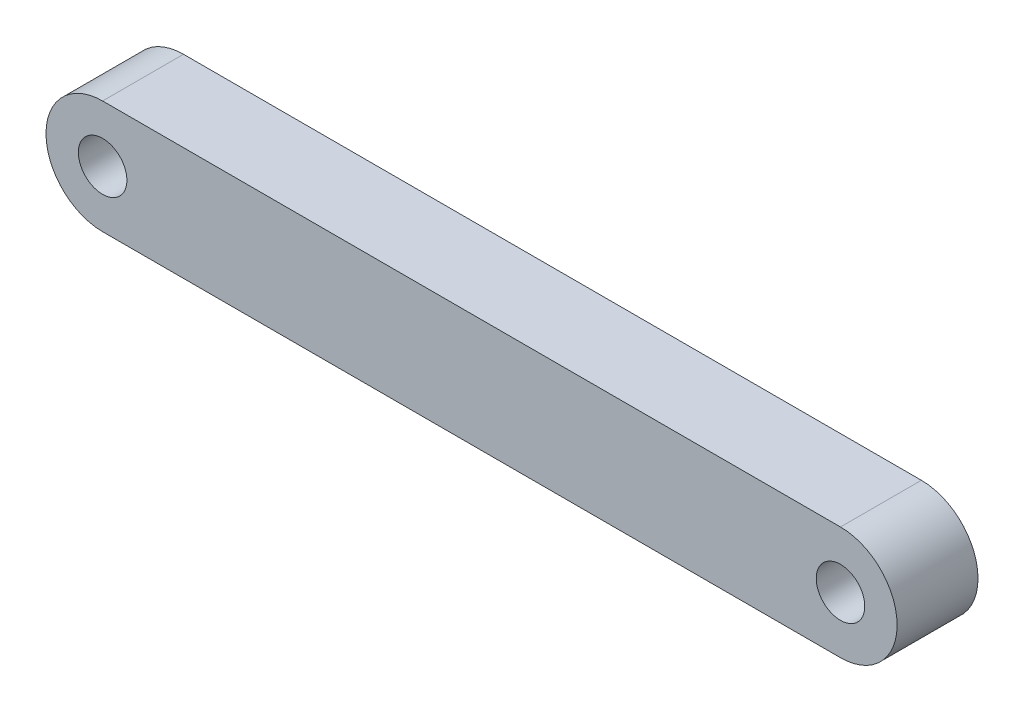
ISO-10303-21;
HEADER;
FILE_DESCRIPTION(('STEP AP214'),'2;1');
FILE_NAME('part.step','',(''),(''),'','','');
FILE_SCHEMA(('AUTOMOTIVE_DESIGN { 1 0 10303 214 1 1 1 1 }'));
ENDSEC;
DATA;
#1=APPLICATION_CONTEXT('core data for automotive mechanical design processes');
#2=APPLICATION_PROTOCOL_DEFINITION('international standard','automotive_design',2000,#1);
#3=PRODUCT_CONTEXT('',#1,'mechanical');
#4=PRODUCT('Part','Part','',(#3));
#5=PRODUCT_RELATED_PRODUCT_CATEGORY('part','',(#4));
#6=PRODUCT_DEFINITION_FORMATION('','',#4);
#7=PRODUCT_DEFINITION_CONTEXT('part definition',#1,'design');
#8=PRODUCT_DEFINITION('design','',#6,#7);
#9=PRODUCT_DEFINITION_SHAPE('','',#8);
#10=(LENGTH_UNIT() NAMED_UNIT(*) SI_UNIT(.MILLI.,.METRE.));
#11=(NAMED_UNIT(*) PLANE_ANGLE_UNIT() SI_UNIT($,.RADIAN.));
#12=(NAMED_UNIT(*) SI_UNIT($,.STERADIAN.) SOLID_ANGLE_UNIT());
#13=UNCERTAINTY_MEASURE_WITH_UNIT(LENGTH_MEASURE(1.E-05),#10,'distance_accuracy_value','');
#14=(GEOMETRIC_REPRESENTATION_CONTEXT(3) GLOBAL_UNCERTAINTY_ASSIGNED_CONTEXT((#13)) GLOBAL_UNIT_ASSIGNED_CONTEXT((#10,
#11,#12)) REPRESENTATION_CONTEXT('',''));
#15=CARTESIAN_POINT('',(0.,0.,0.));
#16=DIRECTION('',(0.,0.,1.));
#17=DIRECTION('',(1.,0.,0.));
#18=AXIS2_PLACEMENT_3D('',#15,#16,#17);
#19=CARTESIAN_POINT('',(0.,3.5,5.));
#20=DIRECTION('',(0.,-1.,0.));
#21=DIRECTION('',(1.,0.,0.));
#22=AXIS2_PLACEMENT_3D('',#19,#20,#21);
#23=PLANE('',#22);
#24=DIRECTION('',(-1.,0.,0.));
#25=VECTOR('',#24,1.);
#26=CARTESIAN_POINT('',(0.,3.5,0.));
#27=LINE('',#26,#25);
#28=CARTESIAN_POINT('',(0.,3.5,0.));
#29=VERTEX_POINT('',#28);
#30=CARTESIAN_POINT('',(-45.61,3.50000000000001,0.));
#31=VERTEX_POINT('',#30);
#32=EDGE_CURVE('E106',#29,#31,#27,.T.);
#33=ORIENTED_EDGE('',*,*,#32,.T.);
#34=DIRECTION('',(0.,0.,-1.));
#35=VECTOR('',#34,1.);
#36=CARTESIAN_POINT('',(-45.61,3.50000000000001,5.));
#37=LINE('',#36,#35);
#38=CARTESIAN_POINT('',(-45.61,3.50000000000001,5.));
#39=VERTEX_POINT('',#38);
#40=EDGE_CURVE('E11',#39,#31,#37,.T.);
#41=ORIENTED_EDGE('',*,*,#40,.F.);
#42=DIRECTION('',(-1.,0.,0.));
#43=VECTOR('',#42,1.);
#44=CARTESIAN_POINT('',(0.,3.5,5.));
#45=LINE('',#44,#43);
#46=CARTESIAN_POINT('',(0.,3.5,5.));
#47=VERTEX_POINT('',#46);
#48=EDGE_CURVE('E85',#47,#39,#45,.T.);
#49=ORIENTED_EDGE('',*,*,#48,.F.);
#50=DIRECTION('',(0.,0.,-1.));
#51=VECTOR('',#50,1.);
#52=CARTESIAN_POINT('',(0.,3.5,5.));
#53=LINE('',#52,#51);
#54=EDGE_CURVE('E102',#47,#29,#53,.T.);
#55=ORIENTED_EDGE('',*,*,#54,.T.);
#56=EDGE_LOOP('',(#33,#41,#49,#55));
#57=FACE_BOUND('',#56,.T.);
#58=ADVANCED_FACE('F36',(#57),#23,.F.);
#59=CARTESIAN_POINT('',(-45.61,0.,5.));
#60=DIRECTION('',(0.,0.,-1.));
#61=DIRECTION('',(-1.,0.,0.));
#62=AXIS2_PLACEMENT_3D('',#59,#60,#61);
#63=CYLINDRICAL_SURFACE('',#62,3.50000000000001);
#64=CARTESIAN_POINT('',(-45.61,0.,0.));
#65=DIRECTION('',(0.,0.,1.));
#66=DIRECTION('',(1.,0.,0.));
#67=AXIS2_PLACEMENT_3D('',#64,#65,#66);
#68=CIRCLE('',#67,3.50000000000001);
#69=CARTESIAN_POINT('',(-45.61,-3.50000000000001,0.));
#70=VERTEX_POINT('',#69);
#71=EDGE_CURVE('E90',#31,#70,#68,.T.);
#72=ORIENTED_EDGE('',*,*,#71,.T.);
#73=DIRECTION('',(0.,0.,-1.));
#74=VECTOR('',#73,1.);
#75=CARTESIAN_POINT('',(-45.61,-3.50000000000001,5.));
#76=LINE('',#75,#74);
#77=CARTESIAN_POINT('',(-45.61,-3.50000000000001,5.));
#78=VERTEX_POINT('',#77);
#79=EDGE_CURVE('E45',#78,#70,#76,.T.);
#80=ORIENTED_EDGE('',*,*,#79,.F.);
#81=CARTESIAN_POINT('',(-45.61,0.,5.));
#82=DIRECTION('',(0.,0.,1.));
#83=DIRECTION('',(1.,0.,0.));
#84=AXIS2_PLACEMENT_3D('',#81,#82,#83);
#85=CIRCLE('',#84,3.50000000000001);
#86=EDGE_CURVE('E79',#39,#78,#85,.T.);
#87=ORIENTED_EDGE('',*,*,#86,.F.);
#88=ORIENTED_EDGE('',*,*,#40,.T.);
#89=EDGE_LOOP('',(#72,#80,#87,#88));
#90=FACE_BOUND('',#89,.T.);
#91=ADVANCED_FACE('F89',(#90),#63,.T.);
#92=CARTESIAN_POINT('',(0.,-3.5,5.));
#93=DIRECTION('',(0.,-1.,0.));
#94=DIRECTION('',(1.,0.,0.));
#95=AXIS2_PLACEMENT_3D('',#92,#93,#94);
#96=PLANE('',#95);
#97=DIRECTION('',(-1.,0.,0.));
#98=VECTOR('',#97,1.);
#99=CARTESIAN_POINT('',(0.,-3.5,0.));
#100=LINE('',#99,#98);
#101=CARTESIAN_POINT('',(0.,-3.5,0.));
#102=VERTEX_POINT('',#101);
#103=EDGE_CURVE('E110',#102,#70,#100,.T.);
#104=ORIENTED_EDGE('',*,*,#103,.F.);
#105=DIRECTION('',(0.,0.,-1.));
#106=VECTOR('',#105,1.);
#107=CARTESIAN_POINT('',(0.,-3.5,5.));
#108=LINE('',#107,#106);
#109=CARTESIAN_POINT('',(0.,-3.5,5.));
#110=VERTEX_POINT('',#109);
#111=EDGE_CURVE('E69',#110,#102,#108,.T.);
#112=ORIENTED_EDGE('',*,*,#111,.F.);
#113=DIRECTION('',(-1.,0.,0.));
#114=VECTOR('',#113,1.);
#115=CARTESIAN_POINT('',(0.,-3.5,5.));
#116=LINE('',#115,#114);
#117=EDGE_CURVE('E83',#110,#78,#116,.T.);
#118=ORIENTED_EDGE('',*,*,#117,.T.);
#119=ORIENTED_EDGE('',*,*,#79,.T.);
#120=EDGE_LOOP('',(#104,#112,#118,#119));
#121=FACE_BOUND('',#120,.T.);
#122=ADVANCED_FACE('F94',(#121),#96,.T.);
#123=CARTESIAN_POINT('',(0.,0.,5.));
#124=DIRECTION('',(0.,0.,-1.));
#125=DIRECTION('',(-1.,0.,0.));
#126=AXIS2_PLACEMENT_3D('',#123,#124,#125);
#127=CYLINDRICAL_SURFACE('',#126,3.5);
#128=CARTESIAN_POINT('',(0.,0.,0.));
#129=DIRECTION('',(0.,0.,1.));
#130=DIRECTION('',(1.,0.,0.));
#131=AXIS2_PLACEMENT_3D('',#128,#129,#130);
#132=CIRCLE('',#131,3.5);
#133=EDGE_CURVE('E72',#102,#29,#132,.T.);
#134=ORIENTED_EDGE('',*,*,#133,.T.);
#135=ORIENTED_EDGE('',*,*,#54,.F.);
#136=CARTESIAN_POINT('',(0.,0.,5.));
#137=DIRECTION('',(0.,0.,1.));
#138=DIRECTION('',(1.,0.,0.));
#139=AXIS2_PLACEMENT_3D('',#136,#137,#138);
#140=CIRCLE('',#139,3.5);
#141=EDGE_CURVE('E53',#110,#47,#140,.T.);
#142=ORIENTED_EDGE('',*,*,#141,.F.);
#143=ORIENTED_EDGE('',*,*,#111,.T.);
#144=EDGE_LOOP('',(#134,#135,#142,#143));
#145=FACE_BOUND('',#144,.T.);
#146=ADVANCED_FACE('F138',(#145),#127,.T.);
#147=CARTESIAN_POINT('',(-45.61,0.,5.));
#148=DIRECTION('',(0.,0.,-1.));
#149=DIRECTION('',(-1.,0.,0.));
#150=AXIS2_PLACEMENT_3D('',#147,#148,#149);
#151=CYLINDRICAL_SURFACE('',#150,1.5);
#152=CARTESIAN_POINT('',(-45.61,0.,5.));
#153=DIRECTION('',(0.,0.,1.));
#154=DIRECTION('',(1.,0.,0.));
#155=AXIS2_PLACEMENT_3D('',#152,#153,#154);
#156=CIRCLE('',#155,1.5);
#157=CARTESIAN_POINT('',(-44.11,0.,5.));
#158=VERTEX_POINT('',#157);
#159=EDGE_CURVE('E116',#158,#158,#156,.T.);
#160=ORIENTED_EDGE('',*,*,#159,.T.);
#161=EDGE_LOOP('',(#160));
#162=FACE_BOUND('',#161,.T.);
#163=CARTESIAN_POINT('',(-45.61,0.,0.));
#164=DIRECTION('',(0.,0.,1.));
#165=DIRECTION('',(1.,0.,0.));
#166=AXIS2_PLACEMENT_3D('',#163,#164,#165);
#167=CIRCLE('',#166,1.5);
#168=CARTESIAN_POINT('',(-44.11,0.,0.));
#169=VERTEX_POINT('',#168);
#170=EDGE_CURVE('E103',#169,#169,#167,.T.);
#171=ORIENTED_EDGE('',*,*,#170,.F.);
#172=EDGE_LOOP('',(#171));
#173=FACE_BOUND('',#172,.T.);
#174=ADVANCED_FACE('F38',(#162,#173),#151,.F.);
#175=CARTESIAN_POINT('',(0.,0.,5.));
#176=DIRECTION('',(0.,0.,-1.));
#177=DIRECTION('',(-1.,0.,0.));
#178=AXIS2_PLACEMENT_3D('',#175,#176,#177);
#179=CYLINDRICAL_SURFACE('',#178,1.5);
#180=CARTESIAN_POINT('',(0.,0.,5.));
#181=DIRECTION('',(0.,0.,1.));
#182=DIRECTION('',(1.,0.,0.));
#183=AXIS2_PLACEMENT_3D('',#180,#181,#182);
#184=CIRCLE('',#183,1.5);
#185=CARTESIAN_POINT('',(1.5,0.,5.));
#186=VERTEX_POINT('',#185);
#187=EDGE_CURVE('E96',#186,#186,#184,.T.);
#188=ORIENTED_EDGE('',*,*,#187,.T.);
#189=EDGE_LOOP('',(#188));
#190=FACE_BOUND('',#189,.T.);
#191=CARTESIAN_POINT('',(0.,0.,0.));
#192=DIRECTION('',(0.,0.,1.));
#193=DIRECTION('',(1.,0.,0.));
#194=AXIS2_PLACEMENT_3D('',#191,#192,#193);
#195=CIRCLE('',#194,1.5);
#196=CARTESIAN_POINT('',(1.5,0.,0.));
#197=VERTEX_POINT('',#196);
#198=EDGE_CURVE('E113',#197,#197,#195,.T.);
#199=ORIENTED_EDGE('',*,*,#198,.F.);
#200=EDGE_LOOP('',(#199));
#201=FACE_BOUND('',#200,.T.);
#202=ADVANCED_FACE('F128',(#190,#201),#179,.F.);
#203=CARTESIAN_POINT('',(0.,0.,5.));
#204=DIRECTION('',(0.,0.,1.));
#205=DIRECTION('',(1.,0.,0.));
#206=AXIS2_PLACEMENT_3D('',#203,#204,#205);
#207=PLANE('',#206);
#208=ORIENTED_EDGE('',*,*,#159,.F.);
#209=EDGE_LOOP('',(#208));
#210=FACE_BOUND('',#209,.T.);
#211=ORIENTED_EDGE('',*,*,#48,.T.);
#212=ORIENTED_EDGE('',*,*,#86,.T.);
#213=ORIENTED_EDGE('',*,*,#117,.F.);
#214=ORIENTED_EDGE('',*,*,#141,.T.);
#215=EDGE_LOOP('',(#211,#212,#213,#214));
#216=FACE_BOUND('',#215,.T.);
#217=ORIENTED_EDGE('',*,*,#187,.F.);
#218=EDGE_LOOP('',(#217));
#219=FACE_BOUND('',#218,.T.);
#220=ADVANCED_FACE('F80',(#210,#216,#219),#207,.T.);
#221=CARTESIAN_POINT('',(0.,0.,0.));
#222=DIRECTION('',(0.,0.,1.));
#223=DIRECTION('',(1.,0.,0.));
#224=AXIS2_PLACEMENT_3D('',#221,#222,#223);
#225=PLANE('',#224);
#226=ORIENTED_EDGE('',*,*,#170,.T.);
#227=EDGE_LOOP('',(#226));
#228=FACE_BOUND('',#227,.T.);
#229=ORIENTED_EDGE('',*,*,#32,.F.);
#230=ORIENTED_EDGE('',*,*,#133,.F.);
#231=ORIENTED_EDGE('',*,*,#103,.T.);
#232=ORIENTED_EDGE('',*,*,#71,.F.);
#233=EDGE_LOOP('',(#229,#230,#231,#232));
#234=FACE_BOUND('',#233,.T.);
#235=ORIENTED_EDGE('',*,*,#198,.T.);
#236=EDGE_LOOP('',(#235));
#237=FACE_BOUND('',#236,.T.);
#238=ADVANCED_FACE('F121',(#228,#234,#237),#225,.F.);
#239=CLOSED_SHELL('',(#58,#91,#122,#146,#174,#202,#220,#238));
#240=MANIFOLD_SOLID_BREP('B2',#239);
#241=ADVANCED_BREP_SHAPE_REPRESENTATION('',(#18,#240),#14);
#242=SHAPE_DEFINITION_REPRESENTATION(#9,#241);
ENDSEC;
END-ISO-10303-21;
